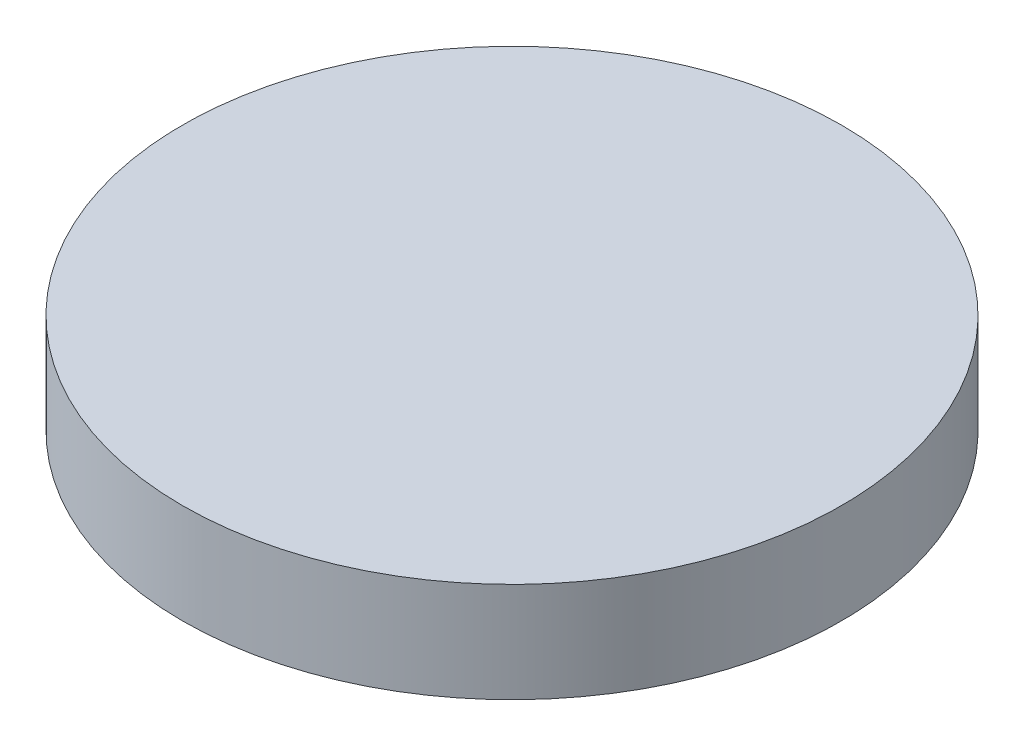
ISO-10303-21;
HEADER;
FILE_DESCRIPTION(('STEP AP214'),'2;1');
FILE_NAME('part.step','',(''),(''),'','','');
FILE_SCHEMA(('AUTOMOTIVE_DESIGN { 1 0 10303 214 1 1 1 1 }'));
ENDSEC;
DATA;
#1=APPLICATION_CONTEXT('core data for automotive mechanical design processes');
#2=APPLICATION_PROTOCOL_DEFINITION('international standard','automotive_design',2000,#1);
#3=PRODUCT_CONTEXT('',#1,'mechanical');
#4=PRODUCT('Part','Part','',(#3));
#5=PRODUCT_RELATED_PRODUCT_CATEGORY('part','',(#4));
#6=PRODUCT_DEFINITION_FORMATION('','',#4);
#7=PRODUCT_DEFINITION_CONTEXT('part definition',#1,'design');
#8=PRODUCT_DEFINITION('design','',#6,#7);
#9=PRODUCT_DEFINITION_SHAPE('','',#8);
#10=(LENGTH_UNIT() NAMED_UNIT(*) SI_UNIT(.MILLI.,.METRE.));
#11=(NAMED_UNIT(*) PLANE_ANGLE_UNIT() SI_UNIT($,.RADIAN.));
#12=(NAMED_UNIT(*) SI_UNIT($,.STERADIAN.) SOLID_ANGLE_UNIT());
#13=UNCERTAINTY_MEASURE_WITH_UNIT(LENGTH_MEASURE(1.E-05),#10,'distance_accuracy_value','');
#14=(GEOMETRIC_REPRESENTATION_CONTEXT(3) GLOBAL_UNCERTAINTY_ASSIGNED_CONTEXT((#13)) GLOBAL_UNIT_ASSIGNED_CONTEXT((#10,
#11,#12)) REPRESENTATION_CONTEXT('',''));
#15=CARTESIAN_POINT('',(0.,0.,0.));
#16=DIRECTION('',(0.,0.,1.));
#17=DIRECTION('',(1.,0.,0.));
#18=AXIS2_PLACEMENT_3D('',#15,#16,#17);
#19=CARTESIAN_POINT('',(0.,0.,0.));
#20=DIRECTION('',(0.,1.,0.));
#21=DIRECTION('',(0.,0.,1.));
#22=AXIS2_PLACEMENT_3D('',#19,#20,#21);
#23=PLANE('',#22);
#24=CARTESIAN_POINT('',(0.,0.,0.));
#25=DIRECTION('',(0.,-1.,0.));
#26=DIRECTION('',(0.,0.,-1.));
#27=AXIS2_PLACEMENT_3D('',#24,#25,#26);
#28=CIRCLE('',#27,1.65);
#29=CARTESIAN_POINT('',(0.,0.,-1.65));
#30=VERTEX_POINT('',#29);
#31=EDGE_CURVE('E18',#30,#30,#28,.F.);
#32=ORIENTED_EDGE('',*,*,#31,.F.);
#33=EDGE_LOOP('',(#32));
#34=FACE_BOUND('',#33,.T.);
#35=ADVANCED_FACE('F15',(#34),#23,.F.);
#36=CARTESIAN_POINT('',(0.,0.5,0.));
#37=DIRECTION('',(0.,-1.,0.));
#38=DIRECTION('',(0.,0.,-1.));
#39=AXIS2_PLACEMENT_3D('',#36,#37,#38);
#40=CYLINDRICAL_SURFACE('',#39,1.65);
#41=ORIENTED_EDGE('',*,*,#31,.T.);
#42=EDGE_LOOP('',(#41));
#43=FACE_BOUND('',#42,.T.);
#44=CARTESIAN_POINT('',(0.,0.5,0.));
#45=DIRECTION('',(0.,-1.,0.));
#46=DIRECTION('',(0.,0.,-1.));
#47=AXIS2_PLACEMENT_3D('',#44,#45,#46);
#48=CIRCLE('',#47,1.65);
#49=CARTESIAN_POINT('',(0.,0.5,-1.65));
#50=VERTEX_POINT('',#49);
#51=EDGE_CURVE('E10',#50,#50,#48,.F.);
#52=ORIENTED_EDGE('',*,*,#51,.F.);
#53=EDGE_LOOP('',(#52));
#54=FACE_BOUND('',#53,.T.);
#55=ADVANCED_FACE('F27',(#43,#54),#40,.T.);
#56=CARTESIAN_POINT('',(0.,0.5,0.));
#57=DIRECTION('',(0.,1.,0.));
#58=DIRECTION('',(0.,0.,1.));
#59=AXIS2_PLACEMENT_3D('',#56,#57,#58);
#60=PLANE('',#59);
#61=ORIENTED_EDGE('',*,*,#51,.T.);
#62=EDGE_LOOP('',(#61));
#63=FACE_BOUND('',#62,.T.);
#64=ADVANCED_FACE('F35',(#63),#60,.T.);
#65=CLOSED_SHELL('',(#35,#55,#64));
#66=MANIFOLD_SOLID_BREP('B1',#65);
#67=ADVANCED_BREP_SHAPE_REPRESENTATION('',(#18,#66),#14);
#68=SHAPE_DEFINITION_REPRESENTATION(#9,#67);
ENDSEC;
END-ISO-10303-21;
